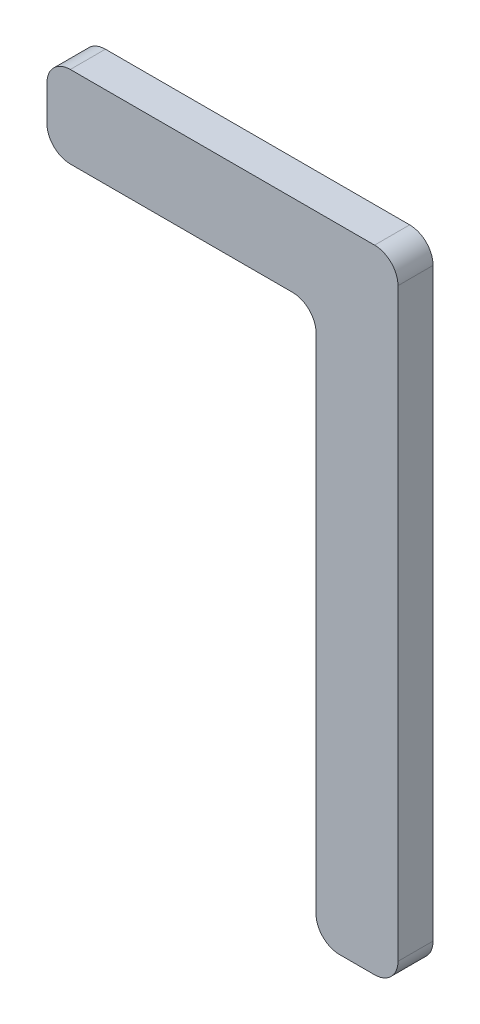
ISO-10303-21;
HEADER;
FILE_DESCRIPTION(('STEP AP214'),'2;1');
FILE_NAME('part.step','',(''),(''),'','','');
FILE_SCHEMA(('AUTOMOTIVE_DESIGN { 1 0 10303 214 1 1 1 1 }'));
ENDSEC;
DATA;
#1=APPLICATION_CONTEXT('core data for automotive mechanical design processes');
#2=APPLICATION_PROTOCOL_DEFINITION('international standard','automotive_design',2000,#1);
#3=PRODUCT_CONTEXT('',#1,'mechanical');
#4=PRODUCT('Part','Part','',(#3));
#5=PRODUCT_RELATED_PRODUCT_CATEGORY('part','',(#4));
#6=PRODUCT_DEFINITION_FORMATION('','',#4);
#7=PRODUCT_DEFINITION_CONTEXT('part definition',#1,'design');
#8=PRODUCT_DEFINITION('design','',#6,#7);
#9=PRODUCT_DEFINITION_SHAPE('','',#8);
#10=(LENGTH_UNIT() NAMED_UNIT(*) SI_UNIT(.MILLI.,.METRE.));
#11=(NAMED_UNIT(*) PLANE_ANGLE_UNIT() SI_UNIT($,.RADIAN.));
#12=(NAMED_UNIT(*) SI_UNIT($,.STERADIAN.) SOLID_ANGLE_UNIT());
#13=UNCERTAINTY_MEASURE_WITH_UNIT(LENGTH_MEASURE(1.E-05),#10,'distance_accuracy_value','');
#14=(GEOMETRIC_REPRESENTATION_CONTEXT(3) GLOBAL_UNCERTAINTY_ASSIGNED_CONTEXT((#13)) GLOBAL_UNIT_ASSIGNED_CONTEXT((#10,
#11,#12)) REPRESENTATION_CONTEXT('',''));
#15=CARTESIAN_POINT('',(0.,0.,0.));
#16=DIRECTION('',(0.,0.,1.));
#17=DIRECTION('',(1.,0.,0.));
#18=AXIS2_PLACEMENT_3D('',#15,#16,#17);
#19=CARTESIAN_POINT('',(105.,-45.,15.));
#20=DIRECTION('',(0.,0.,-1.));
#21=DIRECTION('',(-1.,0.,0.));
#22=AXIS2_PLACEMENT_3D('',#19,#20,#21);
#23=CYLINDRICAL_SURFACE('',#22,10.);
#24=CARTESIAN_POINT('',(105.,-45.,0.));
#25=DIRECTION('',(0.,0.,-1.));
#26=DIRECTION('',(1.,0.,0.));
#27=AXIS2_PLACEMENT_3D('',#24,#25,#26);
#28=CIRCLE('',#27,10.);
#29=CARTESIAN_POINT('',(105.,-35.,0.));
#30=VERTEX_POINT('',#29);
#31=CARTESIAN_POINT('',(115.,-45.,0.));
#32=VERTEX_POINT('',#31);
#33=EDGE_CURVE('E157',#30,#32,#28,.T.);
#34=ORIENTED_EDGE('',*,*,#33,.T.);
#35=DIRECTION('',(0.,0.,-1.));
#36=VECTOR('',#35,1.);
#37=CARTESIAN_POINT('',(115.,-45.,15.));
#38=LINE('',#37,#36);
#39=CARTESIAN_POINT('',(115.,-45.,15.));
#40=VERTEX_POINT('',#39);
#41=EDGE_CURVE('E11',#40,#32,#38,.T.);
#42=ORIENTED_EDGE('',*,*,#41,.F.);
#43=CARTESIAN_POINT('',(105.,-45.,15.));
#44=DIRECTION('',(0.,0.,-1.));
#45=DIRECTION('',(1.,0.,0.));
#46=AXIS2_PLACEMENT_3D('',#43,#44,#45);
#47=CIRCLE('',#46,10.);
#48=CARTESIAN_POINT('',(105.,-35.,15.));
#49=VERTEX_POINT('',#48);
#50=EDGE_CURVE('E179',#49,#40,#47,.T.);
#51=ORIENTED_EDGE('',*,*,#50,.F.);
#52=DIRECTION('',(0.,0.,-1.));
#53=VECTOR('',#52,1.);
#54=CARTESIAN_POINT('',(105.,-35.,15.));
#55=LINE('',#54,#53);
#56=EDGE_CURVE('E153',#49,#30,#55,.T.);
#57=ORIENTED_EDGE('',*,*,#56,.T.);
#58=EDGE_LOOP('',(#34,#42,#51,#57));
#59=FACE_BOUND('',#58,.T.);
#60=ADVANCED_FACE('F37',(#59),#23,.F.);
#61=CARTESIAN_POINT('',(115.,-260.,15.));
#62=DIRECTION('',(1.,0.,0.));
#63=DIRECTION('',(0.,1.,0.));
#64=AXIS2_PLACEMENT_3D('',#61,#62,#63);
#65=PLANE('',#64);
#66=DIRECTION('',(0.,-1.,0.));
#67=VECTOR('',#66,1.);
#68=CARTESIAN_POINT('',(115.,-260.,0.));
#69=LINE('',#68,#67);
#70=CARTESIAN_POINT('',(115.,-260.,0.));
#71=VERTEX_POINT('',#70);
#72=EDGE_CURVE('E160',#32,#71,#69,.T.);
#73=ORIENTED_EDGE('',*,*,#72,.T.);
#74=DIRECTION('',(0.,0.,-1.));
#75=VECTOR('',#74,1.);
#76=CARTESIAN_POINT('',(115.,-260.,15.));
#77=LINE('',#76,#75);
#78=CARTESIAN_POINT('',(115.,-260.,15.));
#79=VERTEX_POINT('',#78);
#80=EDGE_CURVE('E45',#79,#71,#77,.T.);
#81=ORIENTED_EDGE('',*,*,#80,.F.);
#82=DIRECTION('',(0.,-1.,0.));
#83=VECTOR('',#82,1.);
#84=CARTESIAN_POINT('',(115.,-260.,15.));
#85=LINE('',#84,#83);
#86=EDGE_CURVE('E108',#40,#79,#85,.T.);
#87=ORIENTED_EDGE('',*,*,#86,.F.);
#88=ORIENTED_EDGE('',*,*,#41,.T.);
#89=EDGE_LOOP('',(#73,#81,#87,#88));
#90=FACE_BOUND('',#89,.T.);
#91=ADVANCED_FACE('F257',(#90),#65,.F.);
#92=CARTESIAN_POINT('',(125.,-260.,15.));
#93=DIRECTION('',(0.,0.,-1.));
#94=DIRECTION('',(-1.,0.,0.));
#95=AXIS2_PLACEMENT_3D('',#92,#93,#94);
#96=CYLINDRICAL_SURFACE('',#95,9.99999999999998);
#97=CARTESIAN_POINT('',(125.,-260.,0.));
#98=DIRECTION('',(0.,0.,1.));
#99=DIRECTION('',(-1.,0.,0.));
#100=AXIS2_PLACEMENT_3D('',#97,#98,#99);
#101=CIRCLE('',#100,9.99999999999998);
#102=CARTESIAN_POINT('',(125.,-270.,0.));
#103=VERTEX_POINT('',#102);
#104=EDGE_CURVE('E162',#71,#103,#101,.T.);
#105=ORIENTED_EDGE('',*,*,#104,.T.);
#106=DIRECTION('',(0.,0.,-1.));
#107=VECTOR('',#106,1.);
#108=CARTESIAN_POINT('',(125.,-270.,15.));
#109=LINE('',#108,#107);
#110=CARTESIAN_POINT('',(125.,-270.,15.));
#111=VERTEX_POINT('',#110);
#112=EDGE_CURVE('E198',#111,#103,#109,.T.);
#113=ORIENTED_EDGE('',*,*,#112,.F.);
#114=CARTESIAN_POINT('',(125.,-260.,15.));
#115=DIRECTION('',(0.,0.,1.));
#116=DIRECTION('',(-1.,0.,0.));
#117=AXIS2_PLACEMENT_3D('',#114,#115,#116);
#118=CIRCLE('',#117,9.99999999999998);
#119=EDGE_CURVE('E206',#79,#111,#118,.T.);
#120=ORIENTED_EDGE('',*,*,#119,.F.);
#121=ORIENTED_EDGE('',*,*,#80,.T.);
#122=EDGE_LOOP('',(#105,#113,#120,#121));
#123=FACE_BOUND('',#122,.T.);
#124=ADVANCED_FACE('F204',(#123),#96,.T.);
#125=CARTESIAN_POINT('',(140.,-270.,15.));
#126=DIRECTION('',(0.,1.,0.));
#127=DIRECTION('',(-1.,0.,0.));
#128=AXIS2_PLACEMENT_3D('',#125,#126,#127);
#129=PLANE('',#128);
#130=DIRECTION('',(1.,0.,0.));
#131=VECTOR('',#130,1.);
#132=CARTESIAN_POINT('',(140.,-270.,0.));
#133=LINE('',#132,#131);
#134=CARTESIAN_POINT('',(140.,-270.,0.));
#135=VERTEX_POINT('',#134);
#136=EDGE_CURVE('E164',#103,#135,#133,.T.);
#137=ORIENTED_EDGE('',*,*,#136,.T.);
#138=DIRECTION('',(0.,0.,-1.));
#139=VECTOR('',#138,1.);
#140=CARTESIAN_POINT('',(140.,-270.,15.));
#141=LINE('',#140,#139);
#142=CARTESIAN_POINT('',(140.,-270.,15.));
#143=VERTEX_POINT('',#142);
#144=EDGE_CURVE('E195',#143,#135,#141,.T.);
#145=ORIENTED_EDGE('',*,*,#144,.F.);
#146=DIRECTION('',(1.,0.,0.));
#147=VECTOR('',#146,1.);
#148=CARTESIAN_POINT('',(140.,-270.,15.));
#149=LINE('',#148,#147);
#150=EDGE_CURVE('E224',#111,#143,#149,.T.);
#151=ORIENTED_EDGE('',*,*,#150,.F.);
#152=ORIENTED_EDGE('',*,*,#112,.T.);
#153=EDGE_LOOP('',(#137,#145,#151,#152));
#154=FACE_BOUND('',#153,.T.);
#155=ADVANCED_FACE('F215',(#154),#129,.F.);
#156=CARTESIAN_POINT('',(140.,-260.,15.));
#157=DIRECTION('',(0.,0.,-1.));
#158=DIRECTION('',(-1.,0.,0.));
#159=AXIS2_PLACEMENT_3D('',#156,#157,#158);
#160=CYLINDRICAL_SURFACE('',#159,10.);
#161=CARTESIAN_POINT('',(140.,-260.,0.));
#162=DIRECTION('',(0.,0.,1.));
#163=DIRECTION('',(1.,0.,0.));
#164=AXIS2_PLACEMENT_3D('',#161,#162,#163);
#165=CIRCLE('',#164,10.);
#166=CARTESIAN_POINT('',(150.,-260.,0.));
#167=VERTEX_POINT('',#166);
#168=EDGE_CURVE('E166',#135,#167,#165,.T.);
#169=ORIENTED_EDGE('',*,*,#168,.T.);
#170=DIRECTION('',(0.,0.,-1.));
#171=VECTOR('',#170,1.);
#172=CARTESIAN_POINT('',(150.,-260.,15.));
#173=LINE('',#172,#171);
#174=CARTESIAN_POINT('',(150.,-260.,15.));
#175=VERTEX_POINT('',#174);
#176=EDGE_CURVE('E192',#175,#167,#173,.T.);
#177=ORIENTED_EDGE('',*,*,#176,.F.);
#178=CARTESIAN_POINT('',(140.,-260.,15.));
#179=DIRECTION('',(0.,0.,1.));
#180=DIRECTION('',(1.,0.,0.));
#181=AXIS2_PLACEMENT_3D('',#178,#179,#180);
#182=CIRCLE('',#181,10.);
#183=EDGE_CURVE('E221',#143,#175,#182,.T.);
#184=ORIENTED_EDGE('',*,*,#183,.F.);
#185=ORIENTED_EDGE('',*,*,#144,.T.);
#186=EDGE_LOOP('',(#169,#177,#184,#185));
#187=FACE_BOUND('',#186,.T.);
#188=ADVANCED_FACE('F219',(#187),#160,.T.);
#189=CARTESIAN_POINT('',(150.,-10.0000000000001,15.));
#190=DIRECTION('',(-1.,0.,0.));
#191=DIRECTION('',(0.,-1.,0.));
#192=AXIS2_PLACEMENT_3D('',#189,#190,#191);
#193=PLANE('',#192);
#194=DIRECTION('',(0.,1.,0.));
#195=VECTOR('',#194,1.);
#196=CARTESIAN_POINT('',(150.,-10.0000000000001,0.));
#197=LINE('',#196,#195);
#198=CARTESIAN_POINT('',(150.,-10.0000000000001,0.));
#199=VERTEX_POINT('',#198);
#200=EDGE_CURVE('E168',#167,#199,#197,.T.);
#201=ORIENTED_EDGE('',*,*,#200,.T.);
#202=DIRECTION('',(0.,0.,-1.));
#203=VECTOR('',#202,1.);
#204=CARTESIAN_POINT('',(150.,-10.0000000000001,15.));
#205=LINE('',#204,#203);
#206=CARTESIAN_POINT('',(150.,-10.0000000000001,15.));
#207=VERTEX_POINT('',#206);
#208=EDGE_CURVE('E189',#207,#199,#205,.T.);
#209=ORIENTED_EDGE('',*,*,#208,.F.);
#210=DIRECTION('',(0.,1.,0.));
#211=VECTOR('',#210,1.);
#212=CARTESIAN_POINT('',(150.,-10.0000000000001,15.));
#213=LINE('',#212,#211);
#214=EDGE_CURVE('E223',#175,#207,#213,.T.);
#215=ORIENTED_EDGE('',*,*,#214,.F.);
#216=ORIENTED_EDGE('',*,*,#176,.T.);
#217=EDGE_LOOP('',(#201,#209,#215,#216));
#218=FACE_BOUND('',#217,.T.);
#219=ADVANCED_FACE('F270',(#218),#193,.F.);
#220=CARTESIAN_POINT('',(140.,-10.,15.));
#221=DIRECTION('',(0.,0.,-1.));
#222=DIRECTION('',(-1.,0.,0.));
#223=AXIS2_PLACEMENT_3D('',#220,#221,#222);
#224=CYLINDRICAL_SURFACE('',#223,10.);
#225=CARTESIAN_POINT('',(140.,-10.,0.));
#226=DIRECTION('',(0.,0.,1.));
#227=DIRECTION('',(-1.,0.,0.));
#228=AXIS2_PLACEMENT_3D('',#225,#226,#227);
#229=CIRCLE('',#228,10.);
#230=CARTESIAN_POINT('',(140.,0.,0.));
#231=VERTEX_POINT('',#230);
#232=EDGE_CURVE('E170',#199,#231,#229,.T.);
#233=ORIENTED_EDGE('',*,*,#232,.T.);
#234=DIRECTION('',(0.,0.,-1.));
#235=VECTOR('',#234,1.);
#236=CARTESIAN_POINT('',(140.,0.,15.));
#237=LINE('',#236,#235);
#238=CARTESIAN_POINT('',(140.,0.,15.));
#239=VERTEX_POINT('',#238);
#240=EDGE_CURVE('E186',#239,#231,#237,.T.);
#241=ORIENTED_EDGE('',*,*,#240,.F.);
#242=CARTESIAN_POINT('',(140.,-10.,15.));
#243=DIRECTION('',(0.,0.,1.));
#244=DIRECTION('',(-1.,0.,0.));
#245=AXIS2_PLACEMENT_3D('',#242,#243,#244);
#246=CIRCLE('',#245,10.);
#247=EDGE_CURVE('E226',#207,#239,#246,.T.);
#248=ORIENTED_EDGE('',*,*,#247,.F.);
#249=ORIENTED_EDGE('',*,*,#208,.T.);
#250=EDGE_LOOP('',(#233,#241,#248,#249));
#251=FACE_BOUND('',#250,.T.);
#252=ADVANCED_FACE('F273',(#251),#224,.T.);
#253=CARTESIAN_POINT('',(10.0000000000001,0.,15.));
#254=DIRECTION('',(0.,-1.,0.));
#255=DIRECTION('',(0.,0.,-1.));
#256=AXIS2_PLACEMENT_3D('',#253,#254,#255);
#257=PLANE('',#256);
#258=DIRECTION('',(-1.,0.,0.));
#259=VECTOR('',#258,1.);
#260=CARTESIAN_POINT('',(10.0000000000001,0.,0.));
#261=LINE('',#260,#259);
#262=CARTESIAN_POINT('',(10.0000000000001,0.,0.));
#263=VERTEX_POINT('',#262);
#264=EDGE_CURVE('E172',#231,#263,#261,.T.);
#265=ORIENTED_EDGE('',*,*,#264,.T.);
#266=DIRECTION('',(0.,0.,-1.));
#267=VECTOR('',#266,1.);
#268=CARTESIAN_POINT('',(10.0000000000001,0.,15.));
#269=LINE('',#268,#267);
#270=CARTESIAN_POINT('',(10.0000000000001,0.,15.));
#271=VERTEX_POINT('',#270);
#272=EDGE_CURVE('E183',#271,#263,#269,.T.);
#273=ORIENTED_EDGE('',*,*,#272,.F.);
#274=DIRECTION('',(-1.,0.,0.));
#275=VECTOR('',#274,1.);
#276=CARTESIAN_POINT('',(10.0000000000001,0.,15.));
#277=LINE('',#276,#275);
#278=EDGE_CURVE('E232',#239,#271,#277,.T.);
#279=ORIENTED_EDGE('',*,*,#278,.F.);
#280=ORIENTED_EDGE('',*,*,#240,.T.);
#281=EDGE_LOOP('',(#265,#273,#279,#280));
#282=FACE_BOUND('',#281,.T.);
#283=ADVANCED_FACE('F238',(#282),#257,.F.);
#284=CARTESIAN_POINT('',(10.,-10.,15.));
#285=DIRECTION('',(0.,0.,-1.));
#286=DIRECTION('',(-1.,0.,0.));
#287=AXIS2_PLACEMENT_3D('',#284,#285,#286);
#288=CYLINDRICAL_SURFACE('',#287,10.);
#289=CARTESIAN_POINT('',(10.,-10.,0.));
#290=DIRECTION('',(0.,0.,1.));
#291=DIRECTION('',(-1.,0.,0.));
#292=AXIS2_PLACEMENT_3D('',#289,#290,#291);
#293=CIRCLE('',#292,10.);
#294=CARTESIAN_POINT('',(0.,-10.0000000000001,0.));
#295=VERTEX_POINT('',#294);
#296=EDGE_CURVE('E174',#263,#295,#293,.T.);
#297=ORIENTED_EDGE('',*,*,#296,.T.);
#298=DIRECTION('',(0.,0.,-1.));
#299=VECTOR('',#298,1.);
#300=CARTESIAN_POINT('',(0.,-10.0000000000001,15.));
#301=LINE('',#300,#299);
#302=CARTESIAN_POINT('',(0.,-10.0000000000001,15.));
#303=VERTEX_POINT('',#302);
#304=EDGE_CURVE('E148',#303,#295,#301,.T.);
#305=ORIENTED_EDGE('',*,*,#304,.F.);
#306=CARTESIAN_POINT('',(10.,-10.,15.));
#307=DIRECTION('',(0.,0.,1.));
#308=DIRECTION('',(-1.,0.,0.));
#309=AXIS2_PLACEMENT_3D('',#306,#307,#308);
#310=CIRCLE('',#309,10.);
#311=EDGE_CURVE('E139',#271,#303,#310,.T.);
#312=ORIENTED_EDGE('',*,*,#311,.F.);
#313=ORIENTED_EDGE('',*,*,#272,.T.);
#314=EDGE_LOOP('',(#297,#305,#312,#313));
#315=FACE_BOUND('',#314,.T.);
#316=ADVANCED_FACE('F242',(#315),#288,.T.);
#317=CARTESIAN_POINT('',(0.,-24.9999999999999,15.));
#318=DIRECTION('',(1.,0.,0.));
#319=DIRECTION('',(0.,0.,-1.));
#320=AXIS2_PLACEMENT_3D('',#317,#318,#319);
#321=PLANE('',#320);
#322=DIRECTION('',(0.,-1.,0.));
#323=VECTOR('',#322,1.);
#324=CARTESIAN_POINT('',(0.,-24.9999999999999,0.));
#325=LINE('',#324,#323);
#326=CARTESIAN_POINT('',(0.,-24.9999999999999,0.));
#327=VERTEX_POINT('',#326);
#328=EDGE_CURVE('E147',#295,#327,#325,.T.);
#329=ORIENTED_EDGE('',*,*,#328,.T.);
#330=DIRECTION('',(0.,0.,-1.));
#331=VECTOR('',#330,1.);
#332=CARTESIAN_POINT('',(0.,-24.9999999999999,15.));
#333=LINE('',#332,#331);
#334=CARTESIAN_POINT('',(0.,-24.9999999999999,15.));
#335=VERTEX_POINT('',#334);
#336=EDGE_CURVE('E144',#335,#327,#333,.T.);
#337=ORIENTED_EDGE('',*,*,#336,.F.);
#338=DIRECTION('',(0.,-1.,0.));
#339=VECTOR('',#338,1.);
#340=CARTESIAN_POINT('',(0.,-24.9999999999999,15.));
#341=LINE('',#340,#339);
#342=EDGE_CURVE('E133',#303,#335,#341,.T.);
#343=ORIENTED_EDGE('',*,*,#342,.F.);
#344=ORIENTED_EDGE('',*,*,#304,.T.);
#345=EDGE_LOOP('',(#329,#337,#343,#344));
#346=FACE_BOUND('',#345,.T.);
#347=ADVANCED_FACE('F145',(#346),#321,.F.);
#348=CARTESIAN_POINT('',(10.,-25.,15.));
#349=DIRECTION('',(0.,0.,-1.));
#350=DIRECTION('',(-1.,0.,0.));
#351=AXIS2_PLACEMENT_3D('',#348,#349,#350);
#352=CYLINDRICAL_SURFACE('',#351,10.);
#353=CARTESIAN_POINT('',(10.,-25.,0.));
#354=DIRECTION('',(0.,0.,1.));
#355=DIRECTION('',(1.,0.,0.));
#356=AXIS2_PLACEMENT_3D('',#353,#354,#355);
#357=CIRCLE('',#356,10.);
#358=CARTESIAN_POINT('',(10.0000000000001,-35.,0.));
#359=VERTEX_POINT('',#358);
#360=EDGE_CURVE('E94',#327,#359,#357,.T.);
#361=ORIENTED_EDGE('',*,*,#360,.T.);
#362=DIRECTION('',(0.,0.,-1.));
#363=VECTOR('',#362,1.);
#364=CARTESIAN_POINT('',(10.0000000000001,-35.,15.));
#365=LINE('',#364,#363);
#366=CARTESIAN_POINT('',(10.0000000000001,-35.,15.));
#367=VERTEX_POINT('',#366);
#368=EDGE_CURVE('E149',#367,#359,#365,.T.);
#369=ORIENTED_EDGE('',*,*,#368,.F.);
#370=CARTESIAN_POINT('',(10.,-25.,15.));
#371=DIRECTION('',(0.,0.,1.));
#372=DIRECTION('',(1.,0.,0.));
#373=AXIS2_PLACEMENT_3D('',#370,#371,#372);
#374=CIRCLE('',#373,10.);
#375=EDGE_CURVE('E137',#335,#367,#374,.T.);
#376=ORIENTED_EDGE('',*,*,#375,.F.);
#377=ORIENTED_EDGE('',*,*,#336,.T.);
#378=EDGE_LOOP('',(#361,#369,#376,#377));
#379=FACE_BOUND('',#378,.T.);
#380=ADVANCED_FACE('F151',(#379),#352,.T.);
#381=CARTESIAN_POINT('',(105.,-35.,15.));
#382=DIRECTION('',(0.,1.,0.));
#383=DIRECTION('',(-1.,0.,0.));
#384=AXIS2_PLACEMENT_3D('',#381,#382,#383);
#385=PLANE('',#384);
#386=DIRECTION('',(1.,0.,0.));
#387=VECTOR('',#386,1.);
#388=CARTESIAN_POINT('',(105.,-35.,0.));
#389=LINE('',#388,#387);
#390=EDGE_CURVE('E100',#359,#30,#389,.T.);
#391=ORIENTED_EDGE('',*,*,#390,.T.);
#392=ORIENTED_EDGE('',*,*,#56,.F.);
#393=DIRECTION('',(1.,0.,0.));
#394=VECTOR('',#393,1.);
#395=CARTESIAN_POINT('',(105.,-35.,15.));
#396=LINE('',#395,#394);
#397=EDGE_CURVE('E53',#367,#49,#396,.T.);
#398=ORIENTED_EDGE('',*,*,#397,.F.);
#399=ORIENTED_EDGE('',*,*,#368,.T.);
#400=EDGE_LOOP('',(#391,#392,#398,#399));
#401=FACE_BOUND('',#400,.T.);
#402=ADVANCED_FACE('F246',(#401),#385,.F.);
#403=CARTESIAN_POINT('',(105.,-45.,15.));
#404=DIRECTION('',(0.,0.,1.));
#405=DIRECTION('',(1.,0.,0.));
#406=AXIS2_PLACEMENT_3D('',#403,#404,#405);
#407=PLANE('',#406);
#408=ORIENTED_EDGE('',*,*,#50,.T.);
#409=ORIENTED_EDGE('',*,*,#86,.T.);
#410=ORIENTED_EDGE('',*,*,#119,.T.);
#411=ORIENTED_EDGE('',*,*,#150,.T.);
#412=ORIENTED_EDGE('',*,*,#183,.T.);
#413=ORIENTED_EDGE('',*,*,#214,.T.);
#414=ORIENTED_EDGE('',*,*,#247,.T.);
#415=ORIENTED_EDGE('',*,*,#278,.T.);
#416=ORIENTED_EDGE('',*,*,#311,.T.);
#417=ORIENTED_EDGE('',*,*,#342,.T.);
#418=ORIENTED_EDGE('',*,*,#375,.T.);
#419=ORIENTED_EDGE('',*,*,#397,.T.);
#420=EDGE_LOOP('',(#408,#409,#410,#411,#412,#413,#414,#415,#416,#417,#418,#419));
#421=FACE_BOUND('',#420,.T.);
#422=ADVANCED_FACE('F135',(#421),#407,.T.);
#423=CARTESIAN_POINT('',(105.,-45.,0.));
#424=DIRECTION('',(0.,0.,1.));
#425=DIRECTION('',(1.,0.,0.));
#426=AXIS2_PLACEMENT_3D('',#423,#424,#425);
#427=PLANE('',#426);
#428=ORIENTED_EDGE('',*,*,#33,.F.);
#429=ORIENTED_EDGE('',*,*,#390,.F.);
#430=ORIENTED_EDGE('',*,*,#360,.F.);
#431=ORIENTED_EDGE('',*,*,#328,.F.);
#432=ORIENTED_EDGE('',*,*,#296,.F.);
#433=ORIENTED_EDGE('',*,*,#264,.F.);
#434=ORIENTED_EDGE('',*,*,#232,.F.);
#435=ORIENTED_EDGE('',*,*,#200,.F.);
#436=ORIENTED_EDGE('',*,*,#168,.F.);
#437=ORIENTED_EDGE('',*,*,#136,.F.);
#438=ORIENTED_EDGE('',*,*,#104,.F.);
#439=ORIENTED_EDGE('',*,*,#72,.F.);
#440=EDGE_LOOP('',(#428,#429,#430,#431,#432,#433,#434,#435,#436,#437,#438,#439));
#441=FACE_BOUND('',#440,.T.);
#442=ADVANCED_FACE('F210',(#441),#427,.F.);
#443=CLOSED_SHELL('',(#60,#91,#124,#155,#188,#219,#252,#283,#316,#347,#380,#402,#422,#442));
#444=MANIFOLD_SOLID_BREP('B2',#443);
#445=ADVANCED_BREP_SHAPE_REPRESENTATION('',(#18,#444),#14);
#446=SHAPE_DEFINITION_REPRESENTATION(#9,#445);
ENDSEC;
END-ISO-10303-21;
